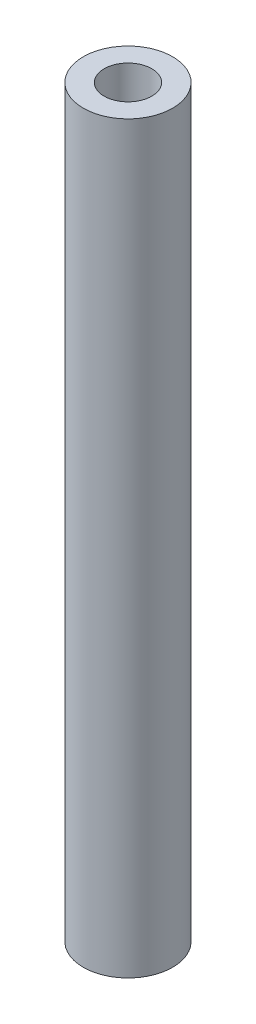
ISO-10303-21;
HEADER;
FILE_DESCRIPTION(('STEP AP214'),'2;1');
FILE_NAME('part.step','',(''),(''),'','','');
FILE_SCHEMA(('AUTOMOTIVE_DESIGN { 1 0 10303 214 1 1 1 1 }'));
ENDSEC;
DATA;
#1=APPLICATION_CONTEXT('core data for automotive mechanical design processes');
#2=APPLICATION_PROTOCOL_DEFINITION('international standard','automotive_design',2000,#1);
#3=PRODUCT_CONTEXT('',#1,'mechanical');
#4=PRODUCT('Part','Part','',(#3));
#5=PRODUCT_RELATED_PRODUCT_CATEGORY('part','',(#4));
#6=PRODUCT_DEFINITION_FORMATION('','',#4);
#7=PRODUCT_DEFINITION_CONTEXT('part definition',#1,'design');
#8=PRODUCT_DEFINITION('design','',#6,#7);
#9=PRODUCT_DEFINITION_SHAPE('','',#8);
#10=(LENGTH_UNIT() NAMED_UNIT(*) SI_UNIT(.MILLI.,.METRE.));
#11=(NAMED_UNIT(*) PLANE_ANGLE_UNIT() SI_UNIT($,.RADIAN.));
#12=(NAMED_UNIT(*) SI_UNIT($,.STERADIAN.) SOLID_ANGLE_UNIT());
#13=UNCERTAINTY_MEASURE_WITH_UNIT(LENGTH_MEASURE(1.E-05),#10,'distance_accuracy_value','');
#14=(GEOMETRIC_REPRESENTATION_CONTEXT(3) GLOBAL_UNCERTAINTY_ASSIGNED_CONTEXT((#13)) GLOBAL_UNIT_ASSIGNED_CONTEXT((#10,
#11,#12)) REPRESENTATION_CONTEXT('',''));
#15=CARTESIAN_POINT('',(0.,0.,0.));
#16=DIRECTION('',(0.,0.,1.));
#17=DIRECTION('',(1.,0.,0.));
#18=AXIS2_PLACEMENT_3D('',#15,#16,#17);
#19=CARTESIAN_POINT('',(0.,50.,0.));
#20=DIRECTION('',(0.,1.,0.));
#21=DIRECTION('',(0.,0.,1.));
#22=AXIS2_PLACEMENT_3D('',#19,#20,#21);
#23=PLANE('',#22);
#24=CARTESIAN_POINT('',(0.,50.,0.));
#25=DIRECTION('',(0.,1.,0.));
#26=DIRECTION('',(0.,0.,1.));
#27=AXIS2_PLACEMENT_3D('',#24,#25,#26);
#28=CIRCLE('',#27,3.);
#29=CARTESIAN_POINT('',(0.,50.,3.));
#30=VERTEX_POINT('',#29);
#31=EDGE_CURVE('E10',#30,#30,#28,.T.);
#32=ORIENTED_EDGE('',*,*,#31,.T.);
#33=EDGE_LOOP('',(#32));
#34=FACE_BOUND('',#33,.T.);
#35=CARTESIAN_POINT('',(0.,50.,0.));
#36=DIRECTION('',(0.,1.,0.));
#37=DIRECTION('',(0.,0.,1.));
#38=AXIS2_PLACEMENT_3D('',#35,#36,#37);
#39=CIRCLE('',#38,1.6);
#40=CARTESIAN_POINT('',(0.,50.,1.6));
#41=VERTEX_POINT('',#40);
#42=EDGE_CURVE('E50',#41,#41,#39,.T.);
#43=ORIENTED_EDGE('',*,*,#42,.F.);
#44=EDGE_LOOP('',(#43));
#45=FACE_BOUND('',#44,.T.);
#46=ADVANCED_FACE('F39',(#34,#45),#23,.T.);
#47=CARTESIAN_POINT('',(0.,0.,0.));
#48=DIRECTION('',(0.,1.,0.));
#49=DIRECTION('',(0.,0.,1.));
#50=AXIS2_PLACEMENT_3D('',#47,#48,#49);
#51=PLANE('',#50);
#52=CARTESIAN_POINT('',(0.,0.,0.));
#53=DIRECTION('',(0.,1.,0.));
#54=DIRECTION('',(0.,0.,1.));
#55=AXIS2_PLACEMENT_3D('',#52,#53,#54);
#56=CIRCLE('',#55,3.);
#57=CARTESIAN_POINT('',(0.,0.,3.));
#58=VERTEX_POINT('',#57);
#59=EDGE_CURVE('E43',#58,#58,#56,.T.);
#60=ORIENTED_EDGE('',*,*,#59,.F.);
#61=EDGE_LOOP('',(#60));
#62=FACE_BOUND('',#61,.T.);
#63=CARTESIAN_POINT('',(0.,0.,0.));
#64=DIRECTION('',(0.,1.,0.));
#65=DIRECTION('',(0.,0.,1.));
#66=AXIS2_PLACEMENT_3D('',#63,#64,#65);
#67=CIRCLE('',#66,1.6);
#68=CARTESIAN_POINT('',(0.,0.,1.6));
#69=VERTEX_POINT('',#68);
#70=EDGE_CURVE('E52',#69,#69,#67,.T.);
#71=ORIENTED_EDGE('',*,*,#70,.T.);
#72=EDGE_LOOP('',(#71));
#73=FACE_BOUND('',#72,.T.);
#74=ADVANCED_FACE('F62',(#62,#73),#51,.F.);
#75=CARTESIAN_POINT('',(0.,50.,0.));
#76=DIRECTION('',(0.,-1.,0.));
#77=DIRECTION('',(0.,0.,-1.));
#78=AXIS2_PLACEMENT_3D('',#75,#76,#77);
#79=CYLINDRICAL_SURFACE('',#78,3.);
#80=ORIENTED_EDGE('',*,*,#31,.F.);
#81=EDGE_LOOP('',(#80));
#82=FACE_BOUND('',#81,.T.);
#83=ORIENTED_EDGE('',*,*,#59,.T.);
#84=EDGE_LOOP('',(#83));
#85=FACE_BOUND('',#84,.T.);
#86=ADVANCED_FACE('F41',(#82,#85),#79,.T.);
#87=CARTESIAN_POINT('',(0.,50.,0.));
#88=DIRECTION('',(0.,-1.,0.));
#89=DIRECTION('',(0.,0.,-1.));
#90=AXIS2_PLACEMENT_3D('',#87,#88,#89);
#91=CYLINDRICAL_SURFACE('',#90,1.6);
#92=ORIENTED_EDGE('',*,*,#42,.T.);
#93=EDGE_LOOP('',(#92));
#94=FACE_BOUND('',#93,.T.);
#95=ORIENTED_EDGE('',*,*,#70,.F.);
#96=EDGE_LOOP('',(#95));
#97=FACE_BOUND('',#96,.T.);
#98=ADVANCED_FACE('F58',(#94,#97),#91,.F.);
#99=CLOSED_SHELL('',(#46,#74,#86,#98));
#100=MANIFOLD_SOLID_BREP('B2',#99);
#101=ADVANCED_BREP_SHAPE_REPRESENTATION('',(#18,#100),#14);
#102=SHAPE_DEFINITION_REPRESENTATION(#9,#101);
ENDSEC;
END-ISO-10303-21;
